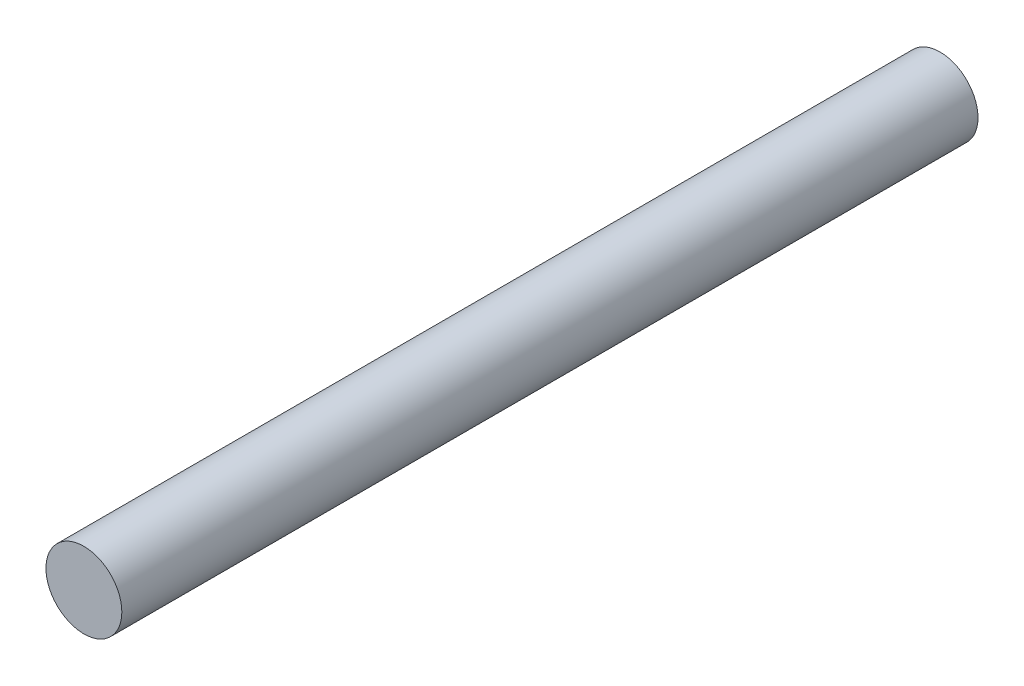
ISO-10303-21;
HEADER;
FILE_DESCRIPTION(('STEP AP214'),'2;1');
FILE_NAME('part.step','',(''),(''),'','','');
FILE_SCHEMA(('AUTOMOTIVE_DESIGN { 1 0 10303 214 1 1 1 1 }'));
ENDSEC;
DATA;
#1=APPLICATION_CONTEXT('core data for automotive mechanical design processes');
#2=APPLICATION_PROTOCOL_DEFINITION('international standard','automotive_design',2000,#1);
#3=PRODUCT_CONTEXT('',#1,'mechanical');
#4=PRODUCT('Part','Part','',(#3));
#5=PRODUCT_RELATED_PRODUCT_CATEGORY('part','',(#4));
#6=PRODUCT_DEFINITION_FORMATION('','',#4);
#7=PRODUCT_DEFINITION_CONTEXT('part definition',#1,'design');
#8=PRODUCT_DEFINITION('design','',#6,#7);
#9=PRODUCT_DEFINITION_SHAPE('','',#8);
#10=(LENGTH_UNIT() NAMED_UNIT(*) SI_UNIT(.MILLI.,.METRE.));
#11=(NAMED_UNIT(*) PLANE_ANGLE_UNIT() SI_UNIT($,.RADIAN.));
#12=(NAMED_UNIT(*) SI_UNIT($,.STERADIAN.) SOLID_ANGLE_UNIT());
#13=UNCERTAINTY_MEASURE_WITH_UNIT(LENGTH_MEASURE(1.E-05),#10,'distance_accuracy_value','');
#14=(GEOMETRIC_REPRESENTATION_CONTEXT(3) GLOBAL_UNCERTAINTY_ASSIGNED_CONTEXT((#13)) GLOBAL_UNIT_ASSIGNED_CONTEXT((#10,
#11,#12)) REPRESENTATION_CONTEXT('',''));
#15=CARTESIAN_POINT('',(0.,0.,0.));
#16=DIRECTION('',(0.,0.,1.));
#17=DIRECTION('',(1.,0.,0.));
#18=AXIS2_PLACEMENT_3D('',#15,#16,#17);
#19=CARTESIAN_POINT('',(58.4988216634351,28.8934474203841,-5.));
#20=DIRECTION('',(0.,0.,1.));
#21=DIRECTION('',(1.,0.,0.));
#22=AXIS2_PLACEMENT_3D('',#19,#20,#21);
#23=CYLINDRICAL_SURFACE('',#22,0.664999999999999);
#24=CARTESIAN_POINT('',(58.4988216634351,28.8934474203841,-5.));
#25=DIRECTION('',(0.,0.,1.));
#26=DIRECTION('',(1.,0.,0.));
#27=AXIS2_PLACEMENT_3D('',#24,#25,#26);
#28=CIRCLE('',#27,0.664999999999999);
#29=CARTESIAN_POINT('',(59.1638216634351,28.8934474203841,-5.));
#30=VERTEX_POINT('',#29);
#31=EDGE_CURVE('E10',#30,#30,#28,.T.);
#32=ORIENTED_EDGE('',*,*,#31,.T.);
#33=EDGE_LOOP('',(#32));
#34=FACE_BOUND('',#33,.T.);
#35=CARTESIAN_POINT('',(58.4988216634351,28.8934474203841,10.));
#36=DIRECTION('',(0.,0.,1.));
#37=DIRECTION('',(1.,0.,0.));
#38=AXIS2_PLACEMENT_3D('',#35,#36,#37);
#39=CIRCLE('',#38,0.664999999999999);
#40=CARTESIAN_POINT('',(59.1638216634351,28.8934474203841,10.));
#41=VERTEX_POINT('',#40);
#42=EDGE_CURVE('E37',#41,#41,#39,.T.);
#43=ORIENTED_EDGE('',*,*,#42,.F.);
#44=EDGE_LOOP('',(#43));
#45=FACE_BOUND('',#44,.T.);
#46=ADVANCED_FACE('F31',(#34,#45),#23,.T.);
#47=CARTESIAN_POINT('',(58.4988216634351,28.8934474203841,-5.));
#48=DIRECTION('',(0.,0.,1.));
#49=DIRECTION('',(1.,0.,0.));
#50=AXIS2_PLACEMENT_3D('',#47,#48,#49);
#51=PLANE('',#50);
#52=ORIENTED_EDGE('',*,*,#31,.F.);
#53=EDGE_LOOP('',(#52));
#54=FACE_BOUND('',#53,.T.);
#55=ADVANCED_FACE('F46',(#54),#51,.F.);
#56=CARTESIAN_POINT('',(58.4988216634351,28.8934474203841,10.));
#57=DIRECTION('',(0.,0.,1.));
#58=DIRECTION('',(1.,0.,0.));
#59=AXIS2_PLACEMENT_3D('',#56,#57,#58);
#60=PLANE('',#59);
#61=ORIENTED_EDGE('',*,*,#42,.T.);
#62=EDGE_LOOP('',(#61));
#63=FACE_BOUND('',#62,.T.);
#64=ADVANCED_FACE('F43',(#63),#60,.T.);
#65=CLOSED_SHELL('',(#46,#55,#64));
#66=MANIFOLD_SOLID_BREP('B2',#65);
#67=ADVANCED_BREP_SHAPE_REPRESENTATION('',(#18,#66),#14);
#68=SHAPE_DEFINITION_REPRESENTATION(#9,#67);
ENDSEC;
END-ISO-10303-21;
